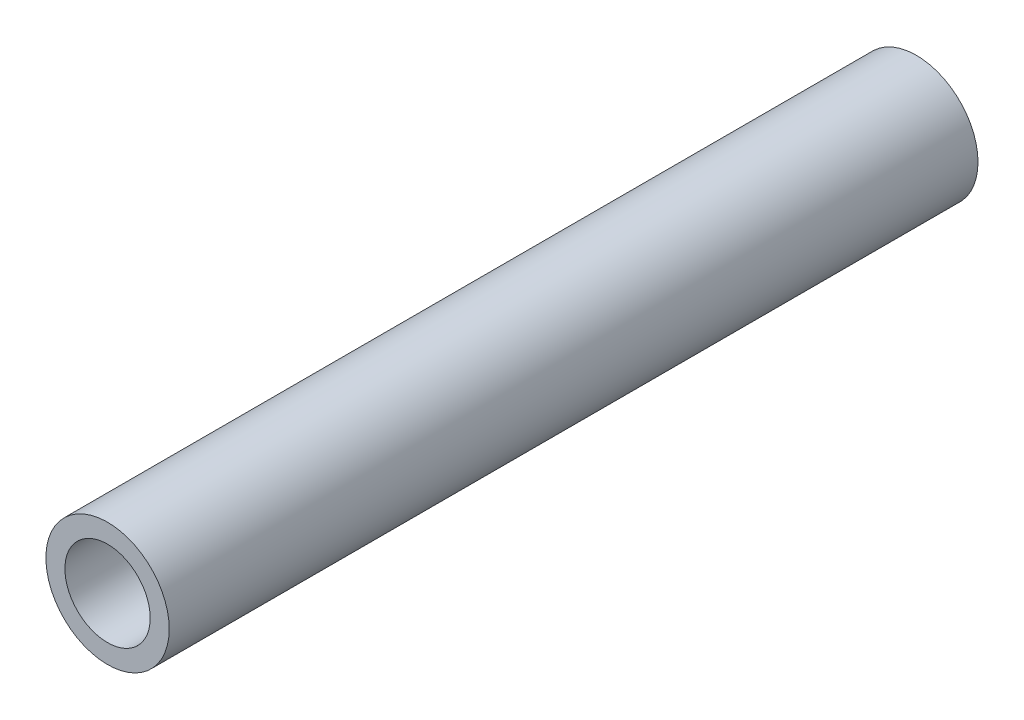
ISO-10303-21;
HEADER;
FILE_DESCRIPTION(('STEP AP214'),'2;1');
FILE_NAME('part.step','',(''),(''),'','','');
FILE_SCHEMA(('AUTOMOTIVE_DESIGN { 1 0 10303 214 1 1 1 1 }'));
ENDSEC;
DATA;
#1=APPLICATION_CONTEXT('core data for automotive mechanical design processes');
#2=APPLICATION_PROTOCOL_DEFINITION('international standard','automotive_design',2000,#1);
#3=PRODUCT_CONTEXT('',#1,'mechanical');
#4=PRODUCT('Part','Part','',(#3));
#5=PRODUCT_RELATED_PRODUCT_CATEGORY('part','',(#4));
#6=PRODUCT_DEFINITION_FORMATION('','',#4);
#7=PRODUCT_DEFINITION_CONTEXT('part definition',#1,'design');
#8=PRODUCT_DEFINITION('design','',#6,#7);
#9=PRODUCT_DEFINITION_SHAPE('','',#8);
#10=(LENGTH_UNIT() NAMED_UNIT(*) SI_UNIT(.MILLI.,.METRE.));
#11=(NAMED_UNIT(*) PLANE_ANGLE_UNIT() SI_UNIT($,.RADIAN.));
#12=(NAMED_UNIT(*) SI_UNIT($,.STERADIAN.) SOLID_ANGLE_UNIT());
#13=UNCERTAINTY_MEASURE_WITH_UNIT(LENGTH_MEASURE(1.E-05),#10,'distance_accuracy_value','');
#14=(GEOMETRIC_REPRESENTATION_CONTEXT(3) GLOBAL_UNCERTAINTY_ASSIGNED_CONTEXT((#13)) GLOBAL_UNIT_ASSIGNED_CONTEXT((#10,
#11,#12)) REPRESENTATION_CONTEXT('',''));
#15=CARTESIAN_POINT('',(0.,0.,0.));
#16=DIRECTION('',(0.,0.,1.));
#17=DIRECTION('',(1.,0.,0.));
#18=AXIS2_PLACEMENT_3D('',#15,#16,#17);
#19=CARTESIAN_POINT('',(0.,0.,101.6));
#20=DIRECTION('',(0.,0.,1.));
#21=DIRECTION('',(1.,0.,0.));
#22=AXIS2_PLACEMENT_3D('',#19,#20,#21);
#23=PLANE('',#22);
#24=CARTESIAN_POINT('',(0.,0.,101.6));
#25=DIRECTION('',(0.,0.,1.));
#26=DIRECTION('',(1.,0.,0.));
#27=AXIS2_PLACEMENT_3D('',#24,#25,#26);
#28=CIRCLE('',#27,7.747);
#29=CARTESIAN_POINT('',(7.747,0.,101.6));
#30=VERTEX_POINT('',#29);
#31=EDGE_CURVE('E10',#30,#30,#28,.T.);
#32=ORIENTED_EDGE('',*,*,#31,.T.);
#33=EDGE_LOOP('',(#32));
#34=FACE_BOUND('',#33,.T.);
#35=CARTESIAN_POINT('',(0.,0.,101.6));
#36=DIRECTION('',(0.,0.,1.));
#37=DIRECTION('',(1.,0.,0.));
#38=AXIS2_PLACEMENT_3D('',#35,#36,#37);
#39=CIRCLE('',#38,5.3594);
#40=CARTESIAN_POINT('',(5.3594,0.,101.6));
#41=VERTEX_POINT('',#40);
#42=EDGE_CURVE('E41',#41,#41,#39,.T.);
#43=ORIENTED_EDGE('',*,*,#42,.F.);
#44=EDGE_LOOP('',(#43));
#45=FACE_BOUND('',#44,.T.);
#46=ADVANCED_FACE('F30',(#34,#45),#23,.T.);
#47=CARTESIAN_POINT('',(0.,0.,0.));
#48=DIRECTION('',(0.,0.,1.));
#49=DIRECTION('',(1.,0.,0.));
#50=AXIS2_PLACEMENT_3D('',#47,#48,#49);
#51=PLANE('',#50);
#52=CARTESIAN_POINT('',(0.,0.,0.));
#53=DIRECTION('',(0.,0.,1.));
#54=DIRECTION('',(1.,0.,0.));
#55=AXIS2_PLACEMENT_3D('',#52,#53,#54);
#56=CIRCLE('',#55,7.747);
#57=CARTESIAN_POINT('',(7.747,0.,0.));
#58=VERTEX_POINT('',#57);
#59=EDGE_CURVE('E34',#58,#58,#56,.T.);
#60=ORIENTED_EDGE('',*,*,#59,.F.);
#61=EDGE_LOOP('',(#60));
#62=FACE_BOUND('',#61,.T.);
#63=CARTESIAN_POINT('',(0.,0.,0.));
#64=DIRECTION('',(0.,0.,1.));
#65=DIRECTION('',(1.,0.,0.));
#66=AXIS2_PLACEMENT_3D('',#63,#64,#65);
#67=CIRCLE('',#66,5.3594);
#68=CARTESIAN_POINT('',(5.3594,0.,0.));
#69=VERTEX_POINT('',#68);
#70=EDGE_CURVE('E43',#69,#69,#67,.T.);
#71=ORIENTED_EDGE('',*,*,#70,.T.);
#72=EDGE_LOOP('',(#71));
#73=FACE_BOUND('',#72,.T.);
#74=ADVANCED_FACE('F53',(#62,#73),#51,.F.);
#75=CARTESIAN_POINT('',(0.,0.,101.6));
#76=DIRECTION('',(0.,0.,-1.));
#77=DIRECTION('',(-1.,0.,0.));
#78=AXIS2_PLACEMENT_3D('',#75,#76,#77);
#79=CYLINDRICAL_SURFACE('',#78,7.747);
#80=ORIENTED_EDGE('',*,*,#31,.F.);
#81=EDGE_LOOP('',(#80));
#82=FACE_BOUND('',#81,.T.);
#83=ORIENTED_EDGE('',*,*,#59,.T.);
#84=EDGE_LOOP('',(#83));
#85=FACE_BOUND('',#84,.T.);
#86=ADVANCED_FACE('F32',(#82,#85),#79,.T.);
#87=CARTESIAN_POINT('',(0.,0.,101.6));
#88=DIRECTION('',(0.,0.,-1.));
#89=DIRECTION('',(-1.,0.,0.));
#90=AXIS2_PLACEMENT_3D('',#87,#88,#89);
#91=CYLINDRICAL_SURFACE('',#90,5.3594);
#92=ORIENTED_EDGE('',*,*,#42,.T.);
#93=EDGE_LOOP('',(#92));
#94=FACE_BOUND('',#93,.T.);
#95=ORIENTED_EDGE('',*,*,#70,.F.);
#96=EDGE_LOOP('',(#95));
#97=FACE_BOUND('',#96,.T.);
#98=ADVANCED_FACE('F49',(#94,#97),#91,.F.);
#99=CLOSED_SHELL('',(#46,#74,#86,#98));
#100=MANIFOLD_SOLID_BREP('B2',#99);
#101=ADVANCED_BREP_SHAPE_REPRESENTATION('',(#18,#100),#14);
#102=SHAPE_DEFINITION_REPRESENTATION(#9,#101);
ENDSEC;
END-ISO-10303-21;
